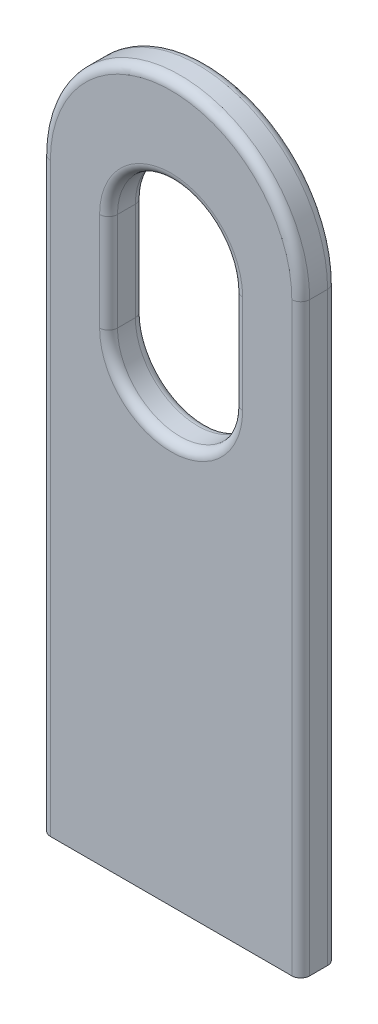
ISO-10303-21;
HEADER;
FILE_DESCRIPTION(('STEP AP214'),'2;1');
FILE_NAME('part.step','',(''),(''),'','','');
FILE_SCHEMA(('AUTOMOTIVE_DESIGN { 1 0 10303 214 1 1 1 1 }'));
ENDSEC;
DATA;
#1=APPLICATION_CONTEXT('core data for automotive mechanical design processes');
#2=APPLICATION_PROTOCOL_DEFINITION('international standard','automotive_design',2000,#1);
#3=PRODUCT_CONTEXT('',#1,'mechanical');
#4=PRODUCT('Part','Part','',(#3));
#5=PRODUCT_RELATED_PRODUCT_CATEGORY('part','',(#4));
#6=PRODUCT_DEFINITION_FORMATION('','',#4);
#7=PRODUCT_DEFINITION_CONTEXT('part definition',#1,'design');
#8=PRODUCT_DEFINITION('design','',#6,#7);
#9=PRODUCT_DEFINITION_SHAPE('','',#8);
#10=(LENGTH_UNIT() NAMED_UNIT(*) SI_UNIT(.MILLI.,.METRE.));
#11=(NAMED_UNIT(*) PLANE_ANGLE_UNIT() SI_UNIT($,.RADIAN.));
#12=(NAMED_UNIT(*) SI_UNIT($,.STERADIAN.) SOLID_ANGLE_UNIT());
#13=UNCERTAINTY_MEASURE_WITH_UNIT(LENGTH_MEASURE(1.E-05),#10,'distance_accuracy_value','');
#14=(GEOMETRIC_REPRESENTATION_CONTEXT(3) GLOBAL_UNCERTAINTY_ASSIGNED_CONTEXT((#13)) GLOBAL_UNIT_ASSIGNED_CONTEXT((#10,
#11,#12)) REPRESENTATION_CONTEXT('',''));
#15=CARTESIAN_POINT('',(0.,0.,0.));
#16=DIRECTION('',(0.,0.,1.));
#17=DIRECTION('',(1.,0.,0.));
#18=AXIS2_PLACEMENT_3D('',#15,#16,#17);
#19=CARTESIAN_POINT('',(0.,5.2,0.200000000000001));
#20=DIRECTION('',(0.,0.,-1.));
#21=DIRECTION('',(-1.,0.,0.));
#22=AXIS2_PLACEMENT_3D('',#19,#20,#21);
#23=CYLINDRICAL_SURFACE('',#22,0.7);
#24=DIRECTION('',(0.,0.,1.));
#25=VECTOR('',#24,1.);
#26=CARTESIAN_POINT('',(-0.7,5.2,0.200000000000001));
#27=LINE('',#26,#25);
#28=CARTESIAN_POINT('',(-0.7,5.2,0.0999999999999994));
#29=VERTEX_POINT('',#28);
#30=CARTESIAN_POINT('',(-0.7,5.2,-0.0999999999999994));
#31=VERTEX_POINT('',#30);
#32=EDGE_CURVE('E157',#29,#31,#27,.F.);
#33=ORIENTED_EDGE('',*,*,#32,.F.);
#34=CARTESIAN_POINT('',(0.,5.2,0.0999999999999994));
#35=DIRECTION('',(0.,0.,1.));
#36=DIRECTION('',(1.,0.,0.));
#37=AXIS2_PLACEMENT_3D('',#34,#35,#36);
#38=CIRCLE('',#37,0.7);
#39=CARTESIAN_POINT('',(0.7,5.2,0.0999999999999994));
#40=VERTEX_POINT('',#39);
#41=EDGE_CURVE('E220',#29,#40,#38,.T.);
#42=ORIENTED_EDGE('',*,*,#41,.T.);
#43=DIRECTION('',(0.,0.,1.));
#44=VECTOR('',#43,1.);
#45=CARTESIAN_POINT('',(0.7,5.2,0.200000000000001));
#46=LINE('',#45,#44);
#47=CARTESIAN_POINT('',(0.7,5.2,-0.0999999999999994));
#48=VERTEX_POINT('',#47);
#49=EDGE_CURVE('E191',#48,#40,#46,.T.);
#50=ORIENTED_EDGE('',*,*,#49,.F.);
#51=CARTESIAN_POINT('',(0.,5.2,-0.0999999999999994));
#52=DIRECTION('',(0.,0.,1.));
#53=DIRECTION('',(1.,0.,0.));
#54=AXIS2_PLACEMENT_3D('',#51,#52,#53);
#55=CIRCLE('',#54,0.7);
#56=EDGE_CURVE('E218',#48,#31,#55,.F.);
#57=ORIENTED_EDGE('',*,*,#56,.T.);
#58=EDGE_LOOP('',(#33,#42,#50,#57));
#59=FACE_BOUND('',#58,.T.);
#60=ADVANCED_FACE('F36',(#59),#23,.F.);
#61=CARTESIAN_POINT('',(0.,6.3,-0.200000000000001));
#62=DIRECTION('',(0.,0.,-1.));
#63=DIRECTION('',(-1.,0.,0.));
#64=AXIS2_PLACEMENT_3D('',#61,#62,#63);
#65=CYLINDRICAL_SURFACE('',#64,0.7);
#66=DIRECTION('',(0.,0.,1.));
#67=VECTOR('',#66,1.);
#68=CARTESIAN_POINT('',(0.7,6.3,-0.200000000000001));
#69=LINE('',#68,#67);
#70=CARTESIAN_POINT('',(0.7,6.3,0.0999999999999994));
#71=VERTEX_POINT('',#70);
#72=CARTESIAN_POINT('',(0.7,6.3,-0.0999999999999994));
#73=VERTEX_POINT('',#72);
#74=EDGE_CURVE('E175',#71,#73,#69,.F.);
#75=ORIENTED_EDGE('',*,*,#74,.F.);
#76=CARTESIAN_POINT('',(0.,6.3,0.0999999999999994));
#77=DIRECTION('',(0.,0.,1.));
#78=DIRECTION('',(1.,0.,0.));
#79=AXIS2_PLACEMENT_3D('',#76,#77,#78);
#80=CIRCLE('',#79,0.7);
#81=CARTESIAN_POINT('',(-0.7,6.3,0.0999999999999994));
#82=VERTEX_POINT('',#81);
#83=EDGE_CURVE('E174',#71,#82,#80,.T.);
#84=ORIENTED_EDGE('',*,*,#83,.T.);
#85=DIRECTION('',(0.,0.,1.));
#86=VECTOR('',#85,1.);
#87=CARTESIAN_POINT('',(-0.7,6.3,-0.200000000000001));
#88=LINE('',#87,#86);
#89=CARTESIAN_POINT('',(-0.7,6.3,-0.0999999999999994));
#90=VERTEX_POINT('',#89);
#91=EDGE_CURVE('E155',#90,#82,#88,.T.);
#92=ORIENTED_EDGE('',*,*,#91,.F.);
#93=CARTESIAN_POINT('',(0.,6.3,-0.0999999999999994));
#94=DIRECTION('',(0.,0.,1.));
#95=DIRECTION('',(1.,0.,0.));
#96=AXIS2_PLACEMENT_3D('',#93,#94,#95);
#97=CIRCLE('',#96,0.7);
#98=EDGE_CURVE('E171',#90,#73,#97,.F.);
#99=ORIENTED_EDGE('',*,*,#98,.T.);
#100=EDGE_LOOP('',(#75,#84,#92,#99));
#101=FACE_BOUND('',#100,.T.);
#102=ADVANCED_FACE('F169',(#101),#65,.F.);
#103=CARTESIAN_POINT('',(0.,6.55,-0.200000000000001));
#104=DIRECTION('',(0.,0.,-1.));
#105=DIRECTION('',(-1.,0.,0.));
#106=AXIS2_PLACEMENT_3D('',#103,#104,#105);
#107=CYLINDRICAL_SURFACE('',#106,1.45);
#108=DIRECTION('',(0.,0.,-1.));
#109=VECTOR('',#108,1.);
#110=CARTESIAN_POINT('',(1.45,6.55,0.200000000000001));
#111=LINE('',#110,#109);
#112=CARTESIAN_POINT('',(1.45,6.55,-0.0999999999999994));
#113=VERTEX_POINT('',#112);
#114=CARTESIAN_POINT('',(1.45,6.55,0.0999999999999994));
#115=VERTEX_POINT('',#114);
#116=EDGE_CURVE('E291',#113,#115,#111,.F.);
#117=ORIENTED_EDGE('',*,*,#116,.F.);
#118=CARTESIAN_POINT('',(0.,6.55,-0.0999999999999994));
#119=DIRECTION('',(0.,0.,1.));
#120=DIRECTION('',(1.,0.,0.));
#121=AXIS2_PLACEMENT_3D('',#118,#119,#120);
#122=CIRCLE('',#121,1.45);
#123=CARTESIAN_POINT('',(-1.45,6.55,-0.0999999999999994));
#124=VERTEX_POINT('',#123);
#125=EDGE_CURVE('E163',#113,#124,#122,.T.);
#126=ORIENTED_EDGE('',*,*,#125,.T.);
#127=DIRECTION('',(0.,0.,-1.));
#128=VECTOR('',#127,1.);
#129=CARTESIAN_POINT('',(-1.45,6.55,0.200000000000001));
#130=LINE('',#129,#128);
#131=CARTESIAN_POINT('',(-1.45,6.55,0.0999999999999994));
#132=VERTEX_POINT('',#131);
#133=EDGE_CURVE('E176',#132,#124,#130,.T.);
#134=ORIENTED_EDGE('',*,*,#133,.F.);
#135=CARTESIAN_POINT('',(0.,6.55,0.0999999999999994));
#136=DIRECTION('',(0.,0.,1.));
#137=DIRECTION('',(1.,0.,0.));
#138=AXIS2_PLACEMENT_3D('',#135,#136,#137);
#139=CIRCLE('',#138,1.45);
#140=EDGE_CURVE('E53',#132,#115,#139,.F.);
#141=ORIENTED_EDGE('',*,*,#140,.T.);
#142=EDGE_LOOP('',(#117,#126,#134,#141));
#143=FACE_BOUND('',#142,.T.);
#144=ADVANCED_FACE('F338',(#143),#107,.T.);
#145=CARTESIAN_POINT('',(-1.45,0.,0.200000000000001));
#146=DIRECTION('',(0.,0.,1.));
#147=DIRECTION('',(1.,0.,0.));
#148=AXIS2_PLACEMENT_3D('',#145,#146,#147);
#149=PLANE('',#148);
#150=DIRECTION('',(0.,-1.,0.));
#151=VECTOR('',#150,1.);
#152=CARTESIAN_POINT('',(-0.800000000000001,0.,0.200000000000001));
#153=LINE('',#152,#151);
#154=CARTESIAN_POINT('',(-0.8,5.2,0.200000000000001));
#155=VERTEX_POINT('',#154);
#156=CARTESIAN_POINT('',(-0.8,6.3,0.200000000000001));
#157=VERTEX_POINT('',#156);
#158=EDGE_CURVE('E205',#155,#157,#153,.F.);
#159=ORIENTED_EDGE('',*,*,#158,.T.);
#160=CARTESIAN_POINT('',(0.,6.3,0.200000000000001));
#161=DIRECTION('',(0.,0.,1.));
#162=DIRECTION('',(1.,0.,0.));
#163=AXIS2_PLACEMENT_3D('',#160,#161,#162);
#164=CIRCLE('',#163,0.8);
#165=CARTESIAN_POINT('',(0.8,6.3,0.200000000000001));
#166=VERTEX_POINT('',#165);
#167=EDGE_CURVE('E211',#157,#166,#164,.F.);
#168=ORIENTED_EDGE('',*,*,#167,.T.);
#169=DIRECTION('',(0.,1.,0.));
#170=VECTOR('',#169,1.);
#171=CARTESIAN_POINT('',(0.800000000000001,0.,0.200000000000001));
#172=LINE('',#171,#170);
#173=CARTESIAN_POINT('',(0.8,5.2,0.200000000000001));
#174=VERTEX_POINT('',#173);
#175=EDGE_CURVE('E209',#166,#174,#172,.F.);
#176=ORIENTED_EDGE('',*,*,#175,.T.);
#177=CARTESIAN_POINT('',(0.,5.2,0.200000000000001));
#178=DIRECTION('',(0.,0.,1.));
#179=DIRECTION('',(1.,0.,0.));
#180=AXIS2_PLACEMENT_3D('',#177,#178,#179);
#181=CIRCLE('',#180,0.8);
#182=EDGE_CURVE('E207',#174,#155,#181,.F.);
#183=ORIENTED_EDGE('',*,*,#182,.T.);
#184=EDGE_LOOP('',(#159,#168,#176,#183));
#185=FACE_BOUND('',#184,.T.);
#186=CARTESIAN_POINT('',(0.,6.55,0.200000000000001));
#187=DIRECTION('',(0.,0.,1.));
#188=DIRECTION('',(1.,0.,0.));
#189=AXIS2_PLACEMENT_3D('',#186,#187,#188);
#190=CIRCLE('',#189,1.35);
#191=CARTESIAN_POINT('',(1.35,6.55,0.200000000000001));
#192=VERTEX_POINT('',#191);
#193=CARTESIAN_POINT('',(-1.34999999999999,6.55,0.200000000000001));
#194=VERTEX_POINT('',#193);
#195=EDGE_CURVE('E200',#192,#194,#190,.T.);
#196=ORIENTED_EDGE('',*,*,#195,.T.);
#197=DIRECTION('',(0.,-1.,0.));
#198=VECTOR('',#197,1.);
#199=CARTESIAN_POINT('',(-1.35,0.,0.200000000000001));
#200=LINE('',#199,#198);
#201=CARTESIAN_POINT('',(-1.35,0.,0.200000000000001));
#202=VERTEX_POINT('',#201);
#203=EDGE_CURVE('E202',#194,#202,#200,.T.);
#204=ORIENTED_EDGE('',*,*,#203,.T.);
#205=DIRECTION('',(1.,0.,0.));
#206=VECTOR('',#205,1.);
#207=CARTESIAN_POINT('',(-1.45,0.,0.200000000000001));
#208=LINE('',#207,#206);
#209=CARTESIAN_POINT('',(1.35,0.,0.200000000000001));
#210=VERTEX_POINT('',#209);
#211=EDGE_CURVE('E300',#202,#210,#208,.T.);
#212=ORIENTED_EDGE('',*,*,#211,.T.);
#213=DIRECTION('',(0.,1.,0.));
#214=VECTOR('',#213,1.);
#215=CARTESIAN_POINT('',(1.35,6.55,0.200000000000001));
#216=LINE('',#215,#214);
#217=EDGE_CURVE('E193',#210,#192,#216,.T.);
#218=ORIENTED_EDGE('',*,*,#217,.T.);
#219=EDGE_LOOP('',(#196,#204,#212,#218));
#220=FACE_BOUND('',#219,.T.);
#221=ADVANCED_FACE('F334',(#185,#220),#149,.T.);
#222=CARTESIAN_POINT('',(-1.45,0.,-0.200000000000001));
#223=DIRECTION('',(0.,0.,1.));
#224=DIRECTION('',(1.,0.,0.));
#225=AXIS2_PLACEMENT_3D('',#222,#223,#224);
#226=PLANE('',#225);
#227=DIRECTION('',(0.,1.,0.));
#228=VECTOR('',#227,1.);
#229=CARTESIAN_POINT('',(0.8,6.3,-0.200000000000001));
#230=LINE('',#229,#228);
#231=CARTESIAN_POINT('',(0.8,5.2,-0.200000000000001));
#232=VERTEX_POINT('',#231);
#233=CARTESIAN_POINT('',(0.8,6.3,-0.200000000000001));
#234=VERTEX_POINT('',#233);
#235=EDGE_CURVE('E231',#232,#234,#230,.T.);
#236=ORIENTED_EDGE('',*,*,#235,.T.);
#237=CARTESIAN_POINT('',(0.,6.3,-0.200000000000001));
#238=DIRECTION('',(0.,0.,1.));
#239=DIRECTION('',(1.,0.,0.));
#240=AXIS2_PLACEMENT_3D('',#237,#238,#239);
#241=CIRCLE('',#240,0.8);
#242=CARTESIAN_POINT('',(-0.8,6.3,-0.200000000000001));
#243=VERTEX_POINT('',#242);
#244=EDGE_CURVE('E233',#234,#243,#241,.T.);
#245=ORIENTED_EDGE('',*,*,#244,.T.);
#246=DIRECTION('',(0.,-1.,0.));
#247=VECTOR('',#246,1.);
#248=CARTESIAN_POINT('',(-0.8,5.2,-0.200000000000001));
#249=LINE('',#248,#247);
#250=CARTESIAN_POINT('',(-0.8,5.2,-0.200000000000001));
#251=VERTEX_POINT('',#250);
#252=EDGE_CURVE('E181',#243,#251,#249,.T.);
#253=ORIENTED_EDGE('',*,*,#252,.T.);
#254=CARTESIAN_POINT('',(0.,5.2,-0.200000000000001));
#255=DIRECTION('',(0.,0.,1.));
#256=DIRECTION('',(1.,0.,0.));
#257=AXIS2_PLACEMENT_3D('',#254,#255,#256);
#258=CIRCLE('',#257,0.8);
#259=EDGE_CURVE('E229',#251,#232,#258,.T.);
#260=ORIENTED_EDGE('',*,*,#259,.T.);
#261=EDGE_LOOP('',(#236,#245,#253,#260));
#262=FACE_BOUND('',#261,.T.);
#263=DIRECTION('',(1.,0.,0.));
#264=VECTOR('',#263,1.);
#265=CARTESIAN_POINT('',(-1.45,0.,-0.200000000000001));
#266=LINE('',#265,#264);
#267=CARTESIAN_POINT('',(-1.35,0.,-0.200000000000001));
#268=VERTEX_POINT('',#267);
#269=CARTESIAN_POINT('',(1.35,0.,-0.200000000000001));
#270=VERTEX_POINT('',#269);
#271=EDGE_CURVE('E263',#268,#270,#266,.T.);
#272=ORIENTED_EDGE('',*,*,#271,.F.);
#273=DIRECTION('',(0.,-1.,0.));
#274=VECTOR('',#273,1.);
#275=CARTESIAN_POINT('',(-1.35,0.,-0.200000000000001));
#276=LINE('',#275,#274);
#277=CARTESIAN_POINT('',(-1.34999999999999,6.55,-0.200000000000001));
#278=VERTEX_POINT('',#277);
#279=EDGE_CURVE('E226',#268,#278,#276,.F.);
#280=ORIENTED_EDGE('',*,*,#279,.T.);
#281=CARTESIAN_POINT('',(0.,6.55,-0.200000000000001));
#282=DIRECTION('',(0.,0.,1.));
#283=DIRECTION('',(1.,0.,0.));
#284=AXIS2_PLACEMENT_3D('',#281,#282,#283);
#285=CIRCLE('',#284,1.35);
#286=CARTESIAN_POINT('',(1.35,6.55,-0.200000000000001));
#287=VERTEX_POINT('',#286);
#288=EDGE_CURVE('E224',#278,#287,#285,.F.);
#289=ORIENTED_EDGE('',*,*,#288,.T.);
#290=DIRECTION('',(0.,1.,0.));
#291=VECTOR('',#290,1.);
#292=CARTESIAN_POINT('',(1.35,0.,-0.200000000000001));
#293=LINE('',#292,#291);
#294=EDGE_CURVE('E222',#287,#270,#293,.F.);
#295=ORIENTED_EDGE('',*,*,#294,.T.);
#296=EDGE_LOOP('',(#272,#280,#289,#295));
#297=FACE_BOUND('',#296,.T.);
#298=ADVANCED_FACE('F337',(#262,#297),#226,.F.);
#299=CARTESIAN_POINT('',(-1.45,8.,0.200000000000001));
#300=DIRECTION('',(1.,0.,0.));
#301=DIRECTION('',(0.,1.,0.));
#302=AXIS2_PLACEMENT_3D('',#299,#300,#301);
#303=PLANE('',#302);
#304=ORIENTED_EDGE('',*,*,#133,.T.);
#305=DIRECTION('',(0.,-1.,0.));
#306=VECTOR('',#305,1.);
#307=CARTESIAN_POINT('',(-1.45,8.,-0.0999999999999994));
#308=LINE('',#307,#306);
#309=CARTESIAN_POINT('',(-1.45,0.,-0.0999999999999994));
#310=VERTEX_POINT('',#309);
#311=EDGE_CURVE('E237',#124,#310,#308,.T.);
#312=ORIENTED_EDGE('',*,*,#311,.T.);
#313=DIRECTION('',(0.,0.,-1.));
#314=VECTOR('',#313,1.);
#315=CARTESIAN_POINT('',(-1.45,0.,0.200000000000001));
#316=LINE('',#315,#314);
#317=CARTESIAN_POINT('',(-1.45,0.,0.0999999999999994));
#318=VERTEX_POINT('',#317);
#319=EDGE_CURVE('E299',#318,#310,#316,.T.);
#320=ORIENTED_EDGE('',*,*,#319,.F.);
#321=DIRECTION('',(0.,-1.,0.));
#322=VECTOR('',#321,1.);
#323=CARTESIAN_POINT('',(-1.45,6.55,0.0999999999999994));
#324=LINE('',#323,#322);
#325=EDGE_CURVE('E235',#318,#132,#324,.F.);
#326=ORIENTED_EDGE('',*,*,#325,.T.);
#327=EDGE_LOOP('',(#304,#312,#320,#326));
#328=FACE_BOUND('',#327,.T.);
#329=ADVANCED_FACE('F343',(#328),#303,.F.);
#330=CARTESIAN_POINT('',(-1.45,0.,0.200000000000001));
#331=DIRECTION('',(0.,1.,0.));
#332=DIRECTION('',(0.,0.,1.));
#333=AXIS2_PLACEMENT_3D('',#330,#331,#332);
#334=PLANE('',#333);
#335=ORIENTED_EDGE('',*,*,#319,.T.);
#336=CARTESIAN_POINT('',(-1.35,0.,-0.0999999999999994));
#337=DIRECTION('',(0.,1.,0.));
#338=DIRECTION('',(0.,0.,1.));
#339=AXIS2_PLACEMENT_3D('',#336,#337,#338);
#340=CIRCLE('',#339,0.1);
#341=EDGE_CURVE('E246',#310,#268,#340,.F.);
#342=ORIENTED_EDGE('',*,*,#341,.T.);
#343=ORIENTED_EDGE('',*,*,#271,.T.);
#344=CARTESIAN_POINT('',(1.35,0.,-0.0999999999999994));
#345=DIRECTION('',(0.,1.,0.));
#346=DIRECTION('',(0.,0.,1.));
#347=AXIS2_PLACEMENT_3D('',#344,#345,#346);
#348=CIRCLE('',#347,0.1);
#349=CARTESIAN_POINT('',(1.45,0.,-0.0999999999999994));
#350=VERTEX_POINT('',#349);
#351=EDGE_CURVE('E242',#270,#350,#348,.F.);
#352=ORIENTED_EDGE('',*,*,#351,.T.);
#353=DIRECTION('',(0.,0.,-1.));
#354=VECTOR('',#353,1.);
#355=CARTESIAN_POINT('',(1.45,0.,0.200000000000001));
#356=LINE('',#355,#354);
#357=CARTESIAN_POINT('',(1.45,0.,0.0999999999999994));
#358=VERTEX_POINT('',#357);
#359=EDGE_CURVE('E290',#358,#350,#356,.T.);
#360=ORIENTED_EDGE('',*,*,#359,.F.);
#361=CARTESIAN_POINT('',(1.35,0.,0.0999999999999994));
#362=DIRECTION('',(0.,1.,0.));
#363=DIRECTION('',(0.,0.,1.));
#364=AXIS2_PLACEMENT_3D('',#361,#362,#363);
#365=CIRCLE('',#364,0.1);
#366=EDGE_CURVE('E240',#358,#210,#365,.F.);
#367=ORIENTED_EDGE('',*,*,#366,.T.);
#368=ORIENTED_EDGE('',*,*,#211,.F.);
#369=CARTESIAN_POINT('',(-1.35,0.,0.0999999999999994));
#370=DIRECTION('',(0.,1.,0.));
#371=DIRECTION('',(0.,0.,1.));
#372=AXIS2_PLACEMENT_3D('',#369,#370,#371);
#373=CIRCLE('',#372,0.1);
#374=EDGE_CURVE('E244',#202,#318,#373,.F.);
#375=ORIENTED_EDGE('',*,*,#374,.T.);
#376=EDGE_LOOP('',(#335,#342,#343,#352,#360,#367,#368,#375));
#377=FACE_BOUND('',#376,.T.);
#378=ADVANCED_FACE('F294',(#377),#334,.F.);
#379=CARTESIAN_POINT('',(1.45,8.,0.200000000000001));
#380=DIRECTION('',(-1.,0.,0.));
#381=DIRECTION('',(0.,-1.,0.));
#382=AXIS2_PLACEMENT_3D('',#379,#380,#381);
#383=PLANE('',#382);
#384=ORIENTED_EDGE('',*,*,#359,.T.);
#385=DIRECTION('',(0.,1.,0.));
#386=VECTOR('',#385,1.);
#387=CARTESIAN_POINT('',(1.45,8.,-0.0999999999999994));
#388=LINE('',#387,#386);
#389=EDGE_CURVE('E11',#350,#113,#388,.T.);
#390=ORIENTED_EDGE('',*,*,#389,.T.);
#391=ORIENTED_EDGE('',*,*,#116,.T.);
#392=DIRECTION('',(0.,1.,0.));
#393=VECTOR('',#392,1.);
#394=CARTESIAN_POINT('',(1.45,0.,0.0999999999999994));
#395=LINE('',#394,#393);
#396=EDGE_CURVE('E45',#115,#358,#395,.F.);
#397=ORIENTED_EDGE('',*,*,#396,.T.);
#398=EDGE_LOOP('',(#384,#390,#391,#397));
#399=FACE_BOUND('',#398,.T.);
#400=ADVANCED_FACE('F289',(#399),#383,.F.);
#401=CARTESIAN_POINT('',(-0.7,7.,0.200000000000001));
#402=DIRECTION('',(1.,0.,0.));
#403=DIRECTION('',(0.,1.,0.));
#404=AXIS2_PLACEMENT_3D('',#401,#402,#403);
#405=PLANE('',#404);
#406=ORIENTED_EDGE('',*,*,#91,.T.);
#407=DIRECTION('',(0.,-1.,0.));
#408=VECTOR('',#407,1.);
#409=CARTESIAN_POINT('',(-0.7,7.,0.0999999999999994));
#410=LINE('',#409,#408);
#411=EDGE_CURVE('E162',#82,#29,#410,.T.);
#412=ORIENTED_EDGE('',*,*,#411,.T.);
#413=ORIENTED_EDGE('',*,*,#32,.T.);
#414=DIRECTION('',(0.,-1.,0.));
#415=VECTOR('',#414,1.);
#416=CARTESIAN_POINT('',(-0.7,6.3,-0.0999999999999994));
#417=LINE('',#416,#415);
#418=EDGE_CURVE('E152',#31,#90,#417,.F.);
#419=ORIENTED_EDGE('',*,*,#418,.T.);
#420=EDGE_LOOP('',(#406,#412,#413,#419));
#421=FACE_BOUND('',#420,.T.);
#422=ADVANCED_FACE('F154',(#421),#405,.T.);
#423=CARTESIAN_POINT('',(0.7,7.,0.200000000000001));
#424=DIRECTION('',(-1.,0.,0.));
#425=DIRECTION('',(0.,-1.,0.));
#426=AXIS2_PLACEMENT_3D('',#423,#424,#425);
#427=PLANE('',#426);
#428=ORIENTED_EDGE('',*,*,#49,.T.);
#429=DIRECTION('',(0.,1.,0.));
#430=VECTOR('',#429,1.);
#431=CARTESIAN_POINT('',(0.7,7.,0.0999999999999994));
#432=LINE('',#431,#430);
#433=EDGE_CURVE('E216',#40,#71,#432,.T.);
#434=ORIENTED_EDGE('',*,*,#433,.T.);
#435=ORIENTED_EDGE('',*,*,#74,.T.);
#436=DIRECTION('',(0.,1.,0.));
#437=VECTOR('',#436,1.);
#438=CARTESIAN_POINT('',(0.7,5.2,-0.0999999999999994));
#439=LINE('',#438,#437);
#440=EDGE_CURVE('E214',#73,#48,#439,.F.);
#441=ORIENTED_EDGE('',*,*,#440,.T.);
#442=EDGE_LOOP('',(#428,#434,#435,#441));
#443=FACE_BOUND('',#442,.T.);
#444=ADVANCED_FACE('F310',(#443),#427,.T.);
#445=CARTESIAN_POINT('',(0.,5.2,0.0999999999999994));
#446=DIRECTION('',(0.,0.,1.));
#447=DIRECTION('',(1.,0.,0.));
#448=AXIS2_PLACEMENT_3D('',#445,#446,#447);
#449=TOROIDAL_SURFACE('',#448,0.8,0.1);
#450=CARTESIAN_POINT('',(-0.8,5.2,0.0999999999999994));
#451=DIRECTION('',(0.,1.,0.));
#452=DIRECTION('',(0.,0.,1.));
#453=AXIS2_PLACEMENT_3D('',#450,#451,#452);
#454=CIRCLE('',#453,0.1);
#455=EDGE_CURVE('E257',#155,#29,#454,.T.);
#456=ORIENTED_EDGE('',*,*,#455,.F.);
#457=ORIENTED_EDGE('',*,*,#182,.F.);
#458=CARTESIAN_POINT('',(0.8,5.2,0.0999999999999994));
#459=DIRECTION('',(0.,1.,0.));
#460=DIRECTION('',(0.,0.,1.));
#461=AXIS2_PLACEMENT_3D('',#458,#459,#460);
#462=CIRCLE('',#461,0.1);
#463=EDGE_CURVE('E260',#40,#174,#462,.T.);
#464=ORIENTED_EDGE('',*,*,#463,.F.);
#465=ORIENTED_EDGE('',*,*,#41,.F.);
#466=EDGE_LOOP('',(#456,#457,#464,#465));
#467=FACE_BOUND('',#466,.T.);
#468=ADVANCED_FACE('F331',(#467),#449,.T.);
#469=CARTESIAN_POINT('',(0.8,7.,0.0999999999999994));
#470=DIRECTION('',(0.,1.,0.));
#471=DIRECTION('',(-1.,0.,0.));
#472=AXIS2_PLACEMENT_3D('',#469,#470,#471);
#473=CYLINDRICAL_SURFACE('',#472,0.1);
#474=ORIENTED_EDGE('',*,*,#463,.T.);
#475=ORIENTED_EDGE('',*,*,#175,.F.);
#476=CARTESIAN_POINT('',(0.8,6.3,0.0999999999999994));
#477=DIRECTION('',(0.,1.,0.));
#478=DIRECTION('',(0.,0.,1.));
#479=AXIS2_PLACEMENT_3D('',#476,#477,#478);
#480=CIRCLE('',#479,0.1);
#481=EDGE_CURVE('E254',#71,#166,#480,.T.);
#482=ORIENTED_EDGE('',*,*,#481,.F.);
#483=ORIENTED_EDGE('',*,*,#433,.F.);
#484=EDGE_LOOP('',(#474,#475,#482,#483));
#485=FACE_BOUND('',#484,.T.);
#486=ADVANCED_FACE('F316',(#485),#473,.T.);
#487=CARTESIAN_POINT('',(-0.8,7.,0.0999999999999994));
#488=DIRECTION('',(0.,-1.,0.));
#489=DIRECTION('',(1.,0.,0.));
#490=AXIS2_PLACEMENT_3D('',#487,#488,#489);
#491=CYLINDRICAL_SURFACE('',#490,0.1);
#492=ORIENTED_EDGE('',*,*,#455,.T.);
#493=ORIENTED_EDGE('',*,*,#411,.F.);
#494=CARTESIAN_POINT('',(-0.8,6.3,0.0999999999999994));
#495=DIRECTION('',(0.,1.,0.));
#496=DIRECTION('',(0.,0.,1.));
#497=AXIS2_PLACEMENT_3D('',#494,#495,#496);
#498=CIRCLE('',#497,0.1);
#499=EDGE_CURVE('E252',#157,#82,#498,.T.);
#500=ORIENTED_EDGE('',*,*,#499,.F.);
#501=ORIENTED_EDGE('',*,*,#158,.F.);
#502=EDGE_LOOP('',(#492,#493,#500,#501));
#503=FACE_BOUND('',#502,.T.);
#504=ADVANCED_FACE('F324',(#503),#491,.T.);
#505=CARTESIAN_POINT('',(0.,6.3,0.0999999999999994));
#506=DIRECTION('',(0.,0.,1.));
#507=DIRECTION('',(1.,0.,0.));
#508=AXIS2_PLACEMENT_3D('',#505,#506,#507);
#509=TOROIDAL_SURFACE('',#508,0.8,0.1);
#510=ORIENTED_EDGE('',*,*,#481,.T.);
#511=ORIENTED_EDGE('',*,*,#167,.F.);
#512=ORIENTED_EDGE('',*,*,#499,.T.);
#513=ORIENTED_EDGE('',*,*,#83,.F.);
#514=EDGE_LOOP('',(#510,#511,#512,#513));
#515=FACE_BOUND('',#514,.T.);
#516=ADVANCED_FACE('F319',(#515),#509,.T.);
#517=CARTESIAN_POINT('',(0.,5.2,-0.0999999999999994));
#518=DIRECTION('',(0.,0.,1.));
#519=DIRECTION('',(1.,0.,0.));
#520=AXIS2_PLACEMENT_3D('',#517,#518,#519);
#521=TOROIDAL_SURFACE('',#520,0.8,0.1);
#522=CARTESIAN_POINT('',(0.8,5.2,-0.0999999999999994));
#523=DIRECTION('',(0.,1.,0.));
#524=DIRECTION('',(0.,0.,1.));
#525=AXIS2_PLACEMENT_3D('',#522,#523,#524);
#526=CIRCLE('',#525,0.1);
#527=EDGE_CURVE('E185',#232,#48,#526,.T.);
#528=ORIENTED_EDGE('',*,*,#527,.F.);
#529=ORIENTED_EDGE('',*,*,#259,.F.);
#530=CARTESIAN_POINT('',(-0.8,5.2,-0.0999999999999994));
#531=DIRECTION('',(0.,1.,0.));
#532=DIRECTION('',(0.,0.,1.));
#533=AXIS2_PLACEMENT_3D('',#530,#531,#532);
#534=CIRCLE('',#533,0.1);
#535=EDGE_CURVE('E255',#31,#251,#534,.T.);
#536=ORIENTED_EDGE('',*,*,#535,.F.);
#537=ORIENTED_EDGE('',*,*,#56,.F.);
#538=EDGE_LOOP('',(#528,#529,#536,#537));
#539=FACE_BOUND('',#538,.T.);
#540=ADVANCED_FACE('F373',(#539),#521,.T.);
#541=CARTESIAN_POINT('',(-0.800000000000001,0.,-0.0999999999999994));
#542=DIRECTION('',(0.,1.,0.));
#543=DIRECTION('',(-1.,0.,0.));
#544=AXIS2_PLACEMENT_3D('',#541,#542,#543);
#545=CYLINDRICAL_SURFACE('',#544,0.1);
#546=ORIENTED_EDGE('',*,*,#535,.T.);
#547=ORIENTED_EDGE('',*,*,#252,.F.);
#548=CARTESIAN_POINT('',(-0.8,6.3,-0.0999999999999994));
#549=DIRECTION('',(0.,1.,0.));
#550=DIRECTION('',(0.,0.,1.));
#551=AXIS2_PLACEMENT_3D('',#548,#549,#550);
#552=CIRCLE('',#551,0.1);
#553=EDGE_CURVE('E179',#90,#243,#552,.T.);
#554=ORIENTED_EDGE('',*,*,#553,.F.);
#555=ORIENTED_EDGE('',*,*,#418,.F.);
#556=EDGE_LOOP('',(#546,#547,#554,#555));
#557=FACE_BOUND('',#556,.T.);
#558=ADVANCED_FACE('F180',(#557),#545,.T.);
#559=CARTESIAN_POINT('',(0.800000000000001,0.,-0.0999999999999994));
#560=DIRECTION('',(0.,-1.,0.));
#561=DIRECTION('',(1.,0.,0.));
#562=AXIS2_PLACEMENT_3D('',#559,#560,#561);
#563=CYLINDRICAL_SURFACE('',#562,0.1);
#564=ORIENTED_EDGE('',*,*,#527,.T.);
#565=ORIENTED_EDGE('',*,*,#440,.F.);
#566=CARTESIAN_POINT('',(0.8,6.3,-0.0999999999999994));
#567=DIRECTION('',(0.,1.,0.));
#568=DIRECTION('',(0.,0.,1.));
#569=AXIS2_PLACEMENT_3D('',#566,#567,#568);
#570=CIRCLE('',#569,0.1);
#571=EDGE_CURVE('E186',#234,#73,#570,.T.);
#572=ORIENTED_EDGE('',*,*,#571,.F.);
#573=ORIENTED_EDGE('',*,*,#235,.F.);
#574=EDGE_LOOP('',(#564,#565,#572,#573));
#575=FACE_BOUND('',#574,.T.);
#576=ADVANCED_FACE('F382',(#575),#563,.T.);
#577=CARTESIAN_POINT('',(0.,6.3,-0.0999999999999994));
#578=DIRECTION('',(0.,0.,1.));
#579=DIRECTION('',(1.,0.,0.));
#580=AXIS2_PLACEMENT_3D('',#577,#578,#579);
#581=TOROIDAL_SURFACE('',#580,0.8,0.1);
#582=ORIENTED_EDGE('',*,*,#553,.T.);
#583=ORIENTED_EDGE('',*,*,#244,.F.);
#584=ORIENTED_EDGE('',*,*,#571,.T.);
#585=ORIENTED_EDGE('',*,*,#98,.F.);
#586=EDGE_LOOP('',(#582,#583,#584,#585));
#587=FACE_BOUND('',#586,.T.);
#588=ADVANCED_FACE('F188',(#587),#581,.T.);
#589=CARTESIAN_POINT('',(1.35,8.,-0.0999999999999994));
#590=DIRECTION('',(0.,1.,0.));
#591=DIRECTION('',(-1.,0.,0.));
#592=AXIS2_PLACEMENT_3D('',#589,#590,#591);
#593=CYLINDRICAL_SURFACE('',#592,0.1);
#594=ORIENTED_EDGE('',*,*,#351,.F.);
#595=ORIENTED_EDGE('',*,*,#294,.F.);
#596=CARTESIAN_POINT('',(1.35,6.55,-0.0999999999999994));
#597=DIRECTION('',(0.,1.,0.));
#598=DIRECTION('',(0.,0.,1.));
#599=AXIS2_PLACEMENT_3D('',#596,#597,#598);
#600=CIRCLE('',#599,0.1);
#601=EDGE_CURVE('E264',#113,#287,#600,.T.);
#602=ORIENTED_EDGE('',*,*,#601,.F.);
#603=ORIENTED_EDGE('',*,*,#389,.F.);
#604=EDGE_LOOP('',(#594,#595,#602,#603));
#605=FACE_BOUND('',#604,.T.);
#606=ADVANCED_FACE('F355',(#605),#593,.T.);
#607=CARTESIAN_POINT('',(0.,6.55,-0.0999999999999994));
#608=DIRECTION('',(0.,0.,1.));
#609=DIRECTION('',(1.,0.,0.));
#610=AXIS2_PLACEMENT_3D('',#607,#608,#609);
#611=TOROIDAL_SURFACE('',#610,1.35,0.1);
#612=ORIENTED_EDGE('',*,*,#601,.T.);
#613=ORIENTED_EDGE('',*,*,#288,.F.);
#614=CARTESIAN_POINT('',(-1.34999999999999,6.55,-0.0999999999999994));
#615=DIRECTION('',(0.,-1.,0.));
#616=DIRECTION('',(0.,0.,-1.));
#617=AXIS2_PLACEMENT_3D('',#614,#615,#616);
#618=CIRCLE('',#617,0.1);
#619=EDGE_CURVE('E269',#124,#278,#618,.T.);
#620=ORIENTED_EDGE('',*,*,#619,.F.);
#621=ORIENTED_EDGE('',*,*,#125,.F.);
#622=EDGE_LOOP('',(#612,#613,#620,#621));
#623=FACE_BOUND('',#622,.T.);
#624=ADVANCED_FACE('F358',(#623),#611,.T.);
#625=CARTESIAN_POINT('',(-1.35,8.,-0.0999999999999994));
#626=DIRECTION('',(0.,-1.,0.));
#627=DIRECTION('',(1.,0.,0.));
#628=AXIS2_PLACEMENT_3D('',#625,#626,#627);
#629=CYLINDRICAL_SURFACE('',#628,0.1);
#630=ORIENTED_EDGE('',*,*,#619,.T.);
#631=ORIENTED_EDGE('',*,*,#279,.F.);
#632=ORIENTED_EDGE('',*,*,#341,.F.);
#633=ORIENTED_EDGE('',*,*,#311,.F.);
#634=EDGE_LOOP('',(#630,#631,#632,#633));
#635=FACE_BOUND('',#634,.T.);
#636=ADVANCED_FACE('F347',(#635),#629,.T.);
#637=CARTESIAN_POINT('',(1.35,0.,0.0999999999999994));
#638=DIRECTION('',(0.,-1.,0.));
#639=DIRECTION('',(1.,0.,0.));
#640=AXIS2_PLACEMENT_3D('',#637,#638,#639);
#641=CYLINDRICAL_SURFACE('',#640,0.1);
#642=ORIENTED_EDGE('',*,*,#366,.F.);
#643=ORIENTED_EDGE('',*,*,#396,.F.);
#644=CARTESIAN_POINT('',(1.35,6.55,0.0999999999999994));
#645=DIRECTION('',(0.,1.,0.));
#646=DIRECTION('',(0.,0.,1.));
#647=AXIS2_PLACEMENT_3D('',#644,#645,#646);
#648=CIRCLE('',#647,0.1);
#649=EDGE_CURVE('E40',#192,#115,#648,.T.);
#650=ORIENTED_EDGE('',*,*,#649,.F.);
#651=ORIENTED_EDGE('',*,*,#217,.F.);
#652=EDGE_LOOP('',(#642,#643,#650,#651));
#653=FACE_BOUND('',#652,.T.);
#654=ADVANCED_FACE('F38',(#653),#641,.T.);
#655=CARTESIAN_POINT('',(0.,6.55,0.0999999999999994));
#656=DIRECTION('',(0.,0.,1.));
#657=DIRECTION('',(1.,0.,0.));
#658=AXIS2_PLACEMENT_3D('',#655,#656,#657);
#659=TOROIDAL_SURFACE('',#658,1.35,0.1);
#660=ORIENTED_EDGE('',*,*,#649,.T.);
#661=ORIENTED_EDGE('',*,*,#140,.F.);
#662=CARTESIAN_POINT('',(-1.34999999999999,6.55,0.0999999999999994));
#663=DIRECTION('',(0.,-1.,0.));
#664=DIRECTION('',(0.,0.,-1.));
#665=AXIS2_PLACEMENT_3D('',#662,#663,#664);
#666=CIRCLE('',#665,0.1);
#667=EDGE_CURVE('E273',#194,#132,#666,.T.);
#668=ORIENTED_EDGE('',*,*,#667,.F.);
#669=ORIENTED_EDGE('',*,*,#195,.F.);
#670=EDGE_LOOP('',(#660,#661,#668,#669));
#671=FACE_BOUND('',#670,.T.);
#672=ADVANCED_FACE('F283',(#671),#659,.T.);
#673=CARTESIAN_POINT('',(-1.35,0.,0.0999999999999994));
#674=DIRECTION('',(0.,1.,0.));
#675=DIRECTION('',(-1.,0.,0.));
#676=AXIS2_PLACEMENT_3D('',#673,#674,#675);
#677=CYLINDRICAL_SURFACE('',#676,0.1);
#678=ORIENTED_EDGE('',*,*,#667,.T.);
#679=ORIENTED_EDGE('',*,*,#325,.F.);
#680=ORIENTED_EDGE('',*,*,#374,.F.);
#681=ORIENTED_EDGE('',*,*,#203,.F.);
#682=EDGE_LOOP('',(#678,#679,#680,#681));
#683=FACE_BOUND('',#682,.T.);
#684=ADVANCED_FACE('F340',(#683),#677,.T.);
#685=CLOSED_SHELL('',(#60,#102,#144,#221,#298,#329,#378,#400,#422,#444,#468,#486,#504,#516,#540,
#558,#576,#588,#606,#624,#636,#654,#672,#684));
#686=MANIFOLD_SOLID_BREP('B2',#685);
#687=ADVANCED_BREP_SHAPE_REPRESENTATION('',(#18,#686),#14);
#688=SHAPE_DEFINITION_REPRESENTATION(#9,#687);
ENDSEC;
END-ISO-10303-21;
